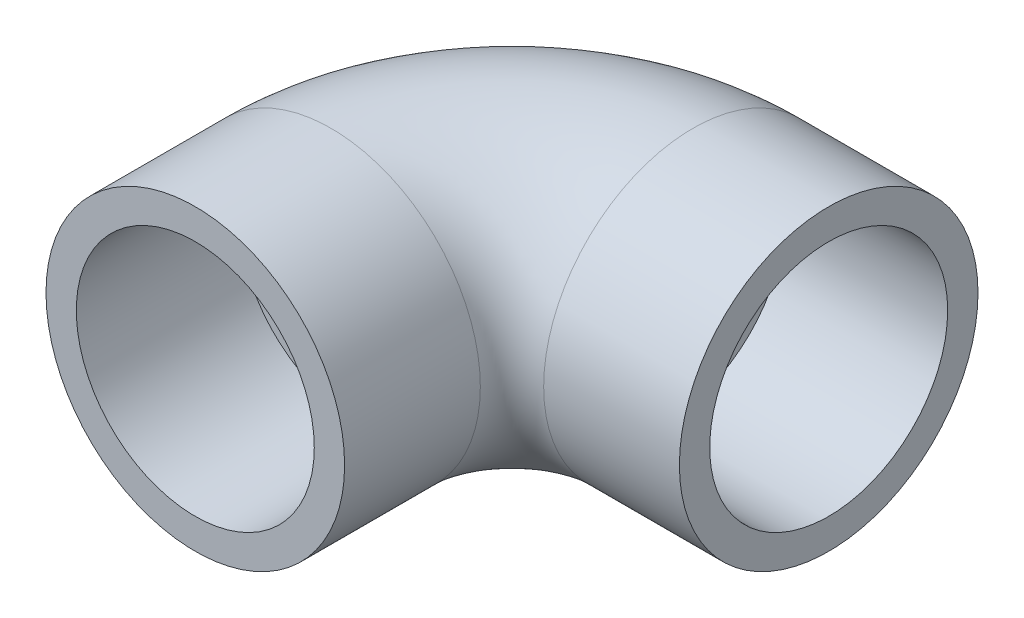
ISO-10303-21;
HEADER;
FILE_DESCRIPTION(('STEP AP214'),'2;1');
FILE_NAME('part.step','',(''),(''),'','','');
FILE_SCHEMA(('AUTOMOTIVE_DESIGN { 1 0 10303 214 1 1 1 1 }'));
ENDSEC;
DATA;
#1=APPLICATION_CONTEXT('core data for automotive mechanical design processes');
#2=APPLICATION_PROTOCOL_DEFINITION('international standard','automotive_design',2000,#1);
#3=PRODUCT_CONTEXT('',#1,'mechanical');
#4=PRODUCT('Part','Part','',(#3));
#5=PRODUCT_RELATED_PRODUCT_CATEGORY('part','',(#4));
#6=PRODUCT_DEFINITION_FORMATION('','',#4);
#7=PRODUCT_DEFINITION_CONTEXT('part definition',#1,'design');
#8=PRODUCT_DEFINITION('design','',#6,#7);
#9=PRODUCT_DEFINITION_SHAPE('','',#8);
#10=(LENGTH_UNIT() NAMED_UNIT(*) SI_UNIT(.MILLI.,.METRE.));
#11=(NAMED_UNIT(*) PLANE_ANGLE_UNIT() SI_UNIT($,.RADIAN.));
#12=(NAMED_UNIT(*) SI_UNIT($,.STERADIAN.) SOLID_ANGLE_UNIT());
#13=UNCERTAINTY_MEASURE_WITH_UNIT(LENGTH_MEASURE(1.E-05),#10,'distance_accuracy_value','');
#14=(GEOMETRIC_REPRESENTATION_CONTEXT(3) GLOBAL_UNCERTAINTY_ASSIGNED_CONTEXT((#13)) GLOBAL_UNIT_ASSIGNED_CONTEXT((#10,
#11,#12)) REPRESENTATION_CONTEXT('',''));
#15=CARTESIAN_POINT('',(0.,0.,0.));
#16=DIRECTION('',(0.,0.,1.));
#17=DIRECTION('',(1.,0.,0.));
#18=AXIS2_PLACEMENT_3D('',#15,#16,#17);
#19=CARTESIAN_POINT('',(25.4,0.,-19.05));
#20=DIRECTION('',(0.,-1.,0.));
#21=DIRECTION('',(0.,0.,-1.));
#22=AXIS2_PLACEMENT_3D('',#19,#20,#21);
#23=TOROIDAL_SURFACE('',#22,25.4,15.621);
#24=CARTESIAN_POINT('',(-10.8784735057506,-11.0133456757389,-22.86));
#25=CARTESIAN_POINT('',(-11.1881948641591,-10.7035151594159,-22.86));
#26=CARTESIAN_POINT('',(-11.4848480918916,-10.3806969330955,-22.86));
#27=CARTESIAN_POINT('',(-12.0500696928626,-9.71116570467934,-22.86));
#28=CARTESIAN_POINT('',(-12.3186308795661,-9.36444662569462,-22.86));
#29=CARTESIAN_POINT('',(-12.8258870785851,-8.64926863352895,-22.86));
#30=CARTESIAN_POINT('',(-13.0645504302218,-8.28078727225361,-22.86));
#31=CARTESIAN_POINT('',(-13.5099630096874,-7.52501595019321,-22.86));
#32=CARTESIAN_POINT('',(-13.7167124315034,-7.13772610375329,-22.86));
#33=CARTESIAN_POINT('',(-14.0967325270345,-6.34722597402654,-22.86));
#34=CARTESIAN_POINT('',(-14.2700151397829,-5.94402143024121,-22.86));
#35=CARTESIAN_POINT('',(-14.5819414962307,-5.1244211727169,-22.86));
#36=CARTESIAN_POINT('',(-14.7205846947873,-4.70802525149294,-22.86));
#37=CARTESIAN_POINT('',(-14.9621931907813,-3.8651198941996,-22.86));
#38=CARTESIAN_POINT('',(-15.0651673431114,-3.43861299632621,-22.86));
#39=CARTESIAN_POINT('',(-15.2347382457155,-2.57842978840346,-22.86));
#40=CARTESIAN_POINT('',(-15.3013351858305,-2.1447535157809,-22.86));
#41=CARTESIAN_POINT('',(-15.3975839090571,-1.27409789921084,-22.86));
#42=CARTESIAN_POINT('',(-15.4273008617413,-0.837125758424779,-22.86));
#43=CARTESIAN_POINT('',(-15.4497904321666,0.0377683239065576,-22.86));
#44=CARTESIAN_POINT('',(-15.442563060336,0.475690265183696,-22.86));
#45=CARTESIAN_POINT('',(-15.391215465377,1.34937897288,-22.86));
#46=CARTESIAN_POINT('',(-15.3470941309715,1.78514567398382,-22.86));
#47=CARTESIAN_POINT('',(-15.2222763128759,2.65140881317267,-22.86));
#48=CARTESIAN_POINT('',(-15.1415798395595,3.08190525275248,-22.86));
#49=CARTESIAN_POINT('',(-14.9442638972296,3.93426957867438,-22.86));
#50=CARTESIAN_POINT('',(-14.8276694190354,4.35614325065768,-22.86));
#51=CARTESIAN_POINT('',(-14.5593802779112,5.18857722379941,-22.86));
#52=CARTESIAN_POINT('',(-14.4076856432406,5.599137534066,-22.86));
#53=CARTESIAN_POINT('',(-14.0702901474023,6.4060369775187,-22.86));
#54=CARTESIAN_POINT('',(-13.8845893767943,6.80237614857287,-22.86));
#55=CARTESIAN_POINT('',(-13.4805183281892,7.57803528736381,-22.86));
#56=CARTESIAN_POINT('',(-13.2621480121507,7.95735523528221,-22.86));
#57=CARTESIAN_POINT('',(-12.7940302736719,8.696743032785,-22.86));
#58=CARTESIAN_POINT('',(-12.5442459588464,9.05678752477991,-22.86));
#59=CARTESIAN_POINT('',(-12.0153008453229,9.75460787070184,-22.86));
#60=CARTESIAN_POINT('',(-11.7361400408191,10.0923837202277,-22.86));
#61=CARTESIAN_POINT('',(-11.1504445952793,10.7433049971072,-22.86));
#62=CARTESIAN_POINT('',(-10.8439098702375,11.0564503488685,-22.86));
#63=CARTESIAN_POINT('',(-10.2056614336273,11.6559328466372,-22.86));
#64=CARTESIAN_POINT('',(-9.87394766073301,11.9422699273467,-22.86));
#65=CARTESIAN_POINT('',(-9.18658581738902,12.487050085864,-22.86));
#66=CARTESIAN_POINT('',(-8.83086303887741,12.7453989023338,-22.86));
#67=CARTESIAN_POINT('',(-8.09900280139839,13.2313482141238,-22.86));
#68=CARTESIAN_POINT('',(-7.72286531545211,13.4589486688075,-22.86));
#69=CARTESIAN_POINT('',(-6.95285210418346,13.8818600434066,-22.86));
#70=CARTESIAN_POINT('',(-6.55897616922635,14.0771705815892,-22.86));
#71=CARTESIAN_POINT('',(-5.75628360508556,14.4341981893787,-22.86));
#72=CARTESIAN_POINT('',(-5.34746691450834,14.5959151209269,-22.86));
#73=CARTESIAN_POINT('',(-4.5152998127864,14.8855669125549,-22.86));
#74=CARTESIAN_POINT('',(-4.09187723997879,15.0132944559067,-22.86));
#75=CARTESIAN_POINT('',(-3.23583444809936,15.2328841378699,-22.86));
#76=CARTESIAN_POINT('',(-2.80321420341991,15.3247461766129,-22.86));
#77=CARTESIAN_POINT('',(-1.93181200165477,15.4720676379061,-22.86));
#78=CARTESIAN_POINT('',(-1.49302990700106,15.5275262463978,-22.86));
#79=CARTESIAN_POINT('',(-0.612375559329773,15.6017675368956,-22.86));
#80=CARTESIAN_POINT('',(-0.170503286574758,15.6205499844304,-22.86));
#81=CARTESIAN_POINT('',(0.71754085585516,15.6214382833182,-22.86));
#82=CARTESIAN_POINT('',(1.16371308720199,15.6031886213093,-22.86));
#83=CARTESIAN_POINT('',(2.0529807811375,15.529563597046,-22.86));
#84=CARTESIAN_POINT('',(2.49607622811675,15.4741880465797,-22.86));
#85=CARTESIAN_POINT('',(3.37615530813767,15.3268382783726,-22.86));
#86=CARTESIAN_POINT('',(3.81313867960756,15.2348624992226,-22.86));
#87=CARTESIAN_POINT('',(4.67800226062167,15.0150944811188,-22.86));
#88=CARTESIAN_POINT('',(5.10588238668134,14.8873019138465,-22.86));
#89=CARTESIAN_POINT('',(5.95561235714101,14.5948709228687,-22.86));
#90=CARTESIAN_POINT('',(6.37729230968197,14.4297387501296,-22.86));
#91=CARTESIAN_POINT('',(7.20545701993348,14.0649790988155,-22.86));
#92=CARTESIAN_POINT('',(7.61194163871383,13.8653513049425,-22.86));
#93=CARTESIAN_POINT('',(8.4070023033064,13.4330829309035,-22.86));
#94=CARTESIAN_POINT('',(8.79557685115698,13.2004395959989,-22.86));
#95=CARTESIAN_POINT('',(9.55217148249618,12.7038366107659,-22.86));
#96=CARTESIAN_POINT('',(9.92019135501577,12.4398766390967,-22.86));
#97=CARTESIAN_POINT('',(10.6387764992207,11.8781172845963,-22.86));
#98=CARTESIAN_POINT('',(10.9889783556024,11.579852863688,-22.86));
#99=CARTESIAN_POINT('',(11.6631333437901,10.9549930762559,-22.86));
#100=CARTESIAN_POINT('',(11.9870860553657,10.6283972563393,-22.86));
#101=CARTESIAN_POINT('',(12.6063640651672,9.94905812636669,-22.86));
#102=CARTESIAN_POINT('',(12.9016874252038,9.59631304887105,-22.86));
#103=CARTESIAN_POINT('',(13.4614695720707,8.86684961821796,-22.86));
#104=CARTESIAN_POINT('',(13.7259137011932,8.49012001016735,-22.86));
#105=CARTESIAN_POINT('',(14.221321394835,7.71549673325917,-22.86));
#106=CARTESIAN_POINT('',(14.4523013350066,7.31761354706783,-22.86));
#107=CARTESIAN_POINT('',(14.8784883564453,6.50337197255311,-22.86));
#108=CARTESIAN_POINT('',(15.0737143579776,6.08702350143273,-22.86));
#109=CARTESIAN_POINT('',(15.4261782328064,5.23866840208691,-22.86));
#110=CARTESIAN_POINT('',(15.5834277267428,4.80666661035814,-22.86));
#111=CARTESIAN_POINT('',(15.857806597658,3.93009966842797,-22.86));
#112=CARTESIAN_POINT('',(15.97493893162,3.48553544680271,-22.86));
#113=CARTESIAN_POINT('',(16.1619401991056,2.61191682943984,-22.86));
#114=CARTESIAN_POINT('',(16.2340389436478,2.18333940086971,-22.86));
#115=CARTESIAN_POINT('',(16.3395004457698,1.32144165316175,-22.86));
#116=CARTESIAN_POINT('',(16.3728649086981,0.888121543677184,-22.86));
#117=CARTESIAN_POINT('',(16.4002673596557,0.0203924542774226,-22.86));
#118=CARTESIAN_POINT('',(16.3943191952543,-0.414016088353728,-22.86));
#119=CARTESIAN_POINT('',(16.3432346216167,-1.28051208250691,-22.86));
#120=CARTESIAN_POINT('',(16.2980992708805,-1.71259959640592,-22.86));
#121=CARTESIAN_POINT('',(16.1734862161919,-2.54394787527235,-22.86));
#122=CARTESIAN_POINT('',(16.0963498387725,-2.94356251692659,-22.86));
#123=CARTESIAN_POINT('',(15.9094529087919,-3.73505846051263,-22.86));
#124=CARTESIAN_POINT('',(15.7996938782589,-4.12694012232153,-22.86));
#125=CARTESIAN_POINT('',(15.5489031370609,-4.90060250598011,-22.86));
#126=CARTESIAN_POINT('',(15.4078672743765,-5.28238187920572,-22.86));
#127=CARTESIAN_POINT('',(15.0960090622366,-6.03371703586924,-22.86));
#128=CARTESIAN_POINT('',(14.9251757772239,-6.40326827217615,-22.86));
#129=CARTESIAN_POINT('',(14.5477409632389,-7.14291591996994,-22.86));
#130=CARTESIAN_POINT('',(14.339956671005,-7.51240875397625,-22.86));
#131=CARTESIAN_POINT('',(13.8956971444647,-8.23370828422674,-22.86));
#132=CARTESIAN_POINT('',(13.6592215574288,-8.58551476296039,-22.86));
#133=CARTESIAN_POINT('',(13.1593254485287,-9.2695874351923,-22.86));
#134=CARTESIAN_POINT('',(12.8958968534151,-9.60184772679809,-22.86));
#135=CARTESIAN_POINT('',(12.3440678236954,-10.2447617190849,-22.86));
#136=CARTESIAN_POINT('',(12.0556743729002,-10.5554214188684,-22.86));
#137=CARTESIAN_POINT('',(11.4348282030561,-11.1742835368008,-22.86));
#138=CARTESIAN_POINT('',(11.1007063019339,-11.4808137423743,-22.86));
#139=CARTESIAN_POINT('',(10.408268207627,-12.0652247314202,-22.86));
#140=CARTESIAN_POINT('',(10.0499509618618,-12.3431042671597,-22.86));
#141=CARTESIAN_POINT('',(9.31152198534265,-12.8683233041681,-22.86));
#142=CARTESIAN_POINT('',(8.93140762505816,-13.1156591093463,-22.86));
#143=CARTESIAN_POINT('',(8.15199114273321,-13.5779814825606,-22.86));
#144=CARTESIAN_POINT('',(7.75268905425995,-13.7929681071861,-22.86));
#145=CARTESIAN_POINT('',(6.9302331201118,-14.1925743310032,-22.86));
#146=CARTESIAN_POINT('',(6.50677901661631,-14.3765764596685,-22.86));
#147=CARTESIAN_POINT('',(5.64575699801038,-14.7079360099192,-22.86));
#148=CARTESIAN_POINT('',(5.20818883528971,-14.855292788221,-22.86));
#149=CARTESIAN_POINT('',(4.32209688426549,-15.1121204873287,-22.86));
#150=CARTESIAN_POINT('',(3.87357380132939,-15.2215938405311,-22.86));
#151=CARTESIAN_POINT('',(2.96879798472354,-15.4016987795302,-22.86));
#152=CARTESIAN_POINT('',(2.51254537380127,-15.4723309815424,-22.86));
#153=CARTESIAN_POINT('',(1.60128730807904,-15.573444110089,-22.86));
#154=CARTESIAN_POINT('',(1.1463354748164,-15.6044079614007,-22.86));
#155=CARTESIAN_POINT('',(0.235460163970252,-15.6274048596583,-22.86));
#156=CARTESIAN_POINT('',(-0.220463312446314,-15.6194379533332,-22.86));
#157=CARTESIAN_POINT('',(-1.13010925841306,-15.5644694882781,-22.86));
#158=CARTESIAN_POINT('',(-1.58383126522278,-15.517460052506,-22.86));
#159=CARTESIAN_POINT('',(-2.25997389193647,-15.4178646865312,-22.86));
#160=CARTESIAN_POINT('',(-2.48462286132228,-15.3798174337091,-22.86));
#161=CARTESIAN_POINT('',(-2.93213378639683,-15.2940755238027,-22.86));
#162=CARTESIAN_POINT('',(-3.15499525627017,-15.246378330607,-22.86));
#163=CARTESIAN_POINT('',(-3.81336569368636,-15.0905334864226,-22.86));
#164=CARTESIAN_POINT('',(-4.24569395234512,-14.968591922928,-22.86));
#165=CARTESIAN_POINT('',(-5.09834249546515,-14.6883694731829,-22.86));
#166=CARTESIAN_POINT('',(-5.51866290598141,-14.530088968566,-22.86));
#167=CARTESIAN_POINT('',(-6.34381360452729,-14.1784366543297,-22.86));
#168=CARTESIAN_POINT('',(-6.74866118082103,-13.9851054834934,-22.86));
#169=CARTESIAN_POINT('',(-7.54023349566654,-13.56464982393,-22.86));
#170=CARTESIAN_POINT('',(-7.92696321242016,-13.3375346904053,-22.86));
#171=CARTESIAN_POINT('',(-8.7675528971815,-12.7941728665765,-22.86));
#172=CARTESIAN_POINT('',(-9.21599720865913,-12.4694975614873,-22.86));
#173=CARTESIAN_POINT('',(-10.0760541335047,-11.774555965557,-22.86));
#174=CARTESIAN_POINT('',(-10.4876669682358,-11.4042899487551,-22.86));
#175=CARTESIAN_POINT('',(-10.8784735057506,-11.0133456757389,-22.86));
#176=B_SPLINE_CURVE_WITH_KNOTS('',3,(#24,#25,#26,#27,#28,#29,#30,#31,#32,#33,#34,#35,#36,#37,
#38,#39,#40,#41,#42,#43,#44,#45,#46,#47,#48,#49,#50,#51,#52,#53,#54,#55,#56,#57,#58,#59,#60,#61,
#62,#63,#64,#65,#66,#67,#68,#69,#70,#71,#72,#73,#74,#75,#76,#77,#78,#79,#80,#81,#82,#83,#84,#85,
#86,#87,#88,#89,#90,#91,#92,#93,#94,#95,#96,#97,#98,#99,#100,#101,#102,#103,#104,#105,#106,#107,
#108,#109,#110,#111,#112,#113,#114,#115,#116,#117,#118,#119,#120,#121,#122,#123,#124,#125,#126,
#127,#128,#129,#130,#131,#132,#133,#134,#135,#136,#137,#138,#139,#140,#141,#142,#143,#144,#145,
#146,#147,#148,#149,#150,#151,#152,#153,#154,#155,#156,#157,#158,#159,#160,#161,#162,#163,#164,
#165,#166,#167,#168,#169,#170,#171,#172,#173,#174,#175),.UNSPECIFIED.,.T.,.F.,(4,2,2,2,2,2,2,2,
2,2,2,2,2,2,2,2,2,2,2,2,2,2,2,2,2,2,2,2,2,2,2,2,2,2,2,2,2,2,2,2,2,2,2,2,2,2,2,2,2,2,2,2,2,2,2,2,
2,2,2,2,2,2,2,2,2,2,2,2,2,2,2,2,2,2,2,4),(0.,1.31378796393087,2.6279112046884,3.94341449539088,
5.25890978956467,6.57393492027791,7.88898074508285,9.20369987348638,10.5184121407306,
11.8307978942211,13.1431832772654,14.4556081918808,15.7680327342532,17.0795456748105,
18.3910575594633,19.7025659515628,21.0140758708344,22.3271406584472,23.6402057055699,
24.9532747823997,26.2663470574336,27.5837124689453,28.9010796214506,30.2184623468178,
31.535850486093,32.8610987854716,34.1863507750121,35.511632399006,36.8369224955197,
38.1749957426297,39.5130757732291,40.8512128940295,42.1893622814065,43.5463646372141,
44.9033793969957,46.26050744952,47.6176494287737,48.9960360407986,50.3744447154726,
51.752946642482,53.1321002774446,54.5105767293981,55.8883215981916,57.2656443475898,
58.6428655544747,59.9449536132391,61.2469843429946,62.548556466938,63.8500934347207,
65.0696785729989,66.2892068197774,67.5088970567243,68.7290358614804,69.9993932633659,
71.2697662845554,72.5405209414752,73.8109212520024,75.1696385282316,76.5284149514515,
77.8873556391526,79.2462939495973,80.6297362354138,82.0132028048869,83.3965805290723,
84.7799363053146,86.1462858071578,87.5126336689536,88.879257265821,89.5626191917224,
90.2461609465647,91.5919857747384,92.9377964696275,94.2820566560375,95.6259452905369,
97.2836934481536,98.94143164177),.UNSPECIFIED.);
#177=CARTESIAN_POINT('',(-10.8784735057506,-11.0133456757389,-22.86));
#178=VERTEX_POINT('',#177);
#179=EDGE_CURVE('E68',#178,#178,#176,.T.);
#180=ORIENTED_EDGE('',*,*,#179,.F.);
#181=EDGE_LOOP('',(#180));
#182=FACE_BOUND('',#181,.T.);
#183=CARTESIAN_POINT('',(21.59,-11.0133456757389,-55.3284735057506));
#184=CARTESIAN_POINT('',(21.59,-11.3256464313226,-55.0162912028326));
#185=CARTESIAN_POINT('',(21.59,-11.6246835924731,-54.6909014719289));
#186=CARTESIAN_POINT('',(21.59,-12.1942909863308,-54.0159078567745));
#187=CARTESIAN_POINT('',(21.59,-12.4648531054451,-53.6662971178658));
#188=CARTESIAN_POINT('',(21.59,-12.9757957183572,-52.9450824584802));
#189=CARTESIAN_POINT('',(21.59,-13.2161412897855,-52.5734538074884));
#190=CARTESIAN_POINT('',(21.59,-13.6646342379529,-51.8112497885135));
#191=CARTESIAN_POINT('',(21.59,-13.8727815333973,-51.4206743726965));
#192=CARTESIAN_POINT('',(21.59,-14.2553015737199,-50.6237232101941));
#193=CARTESIAN_POINT('',(21.59,-14.4297022344753,-50.2173608598377));
#194=CARTESIAN_POINT('',(21.59,-14.7437899086694,-49.3914301469097));
#195=CARTESIAN_POINT('',(21.59,-14.8834763775388,-48.9718615772856));
#196=CARTESIAN_POINT('',(21.59,-15.1272028330096,-48.1226234673896));
#197=CARTESIAN_POINT('',(21.59,-15.2312526240557,-47.6929567401657));
#198=CARTESIAN_POINT('',(21.59,-15.4031302572449,-46.8264418441532));
#199=CARTESIAN_POINT('',(21.59,-15.4709580681217,-46.3895936691659));
#200=CARTESIAN_POINT('',(21.59,-15.570344335897,-45.5089903142026));
#201=CARTESIAN_POINT('',(21.59,-15.6016704608082,-45.0652089158288));
#202=CARTESIAN_POINT('',(21.59,-15.6271797045713,-44.1765827943896));
#203=CARTESIAN_POINT('',(21.59,-15.6213626924293,-43.7317380675796));
#204=CARTESIAN_POINT('',(21.59,-15.5727586707742,-42.8440398287981));
#205=CARTESIAN_POINT('',(21.59,-15.5299686504495,-42.4011864819423));
#206=CARTESIAN_POINT('',(21.59,-15.4078527884472,-41.5205479559756));
#207=CARTESIAN_POINT('',(21.59,-15.3285266371732,-41.0827628198433));
#208=CARTESIAN_POINT('',(21.59,-15.1328006011025,-40.2097583776023));
#209=CARTESIAN_POINT('',(21.59,-15.0159458362509,-39.7746410374525));
#210=CARTESIAN_POINT('',(21.59,-14.7464456535401,-38.915638001289));
#211=CARTESIAN_POINT('',(21.59,-14.5937999702696,-38.4917523885914));
#212=CARTESIAN_POINT('',(21.59,-14.2539102504496,-37.6580703175117));
#213=CARTESIAN_POINT('',(21.59,-14.0666647912955,-37.2482744392651));
#214=CARTESIAN_POINT('',(21.59,-13.6589904305033,-36.445536047953));
#215=CARTESIAN_POINT('',(21.59,-13.4385611826874,-36.0525937107608));
#216=CARTESIAN_POINT('',(21.59,-12.9623352563095,-35.2800436510687));
#217=CARTESIAN_POINT('',(21.59,-12.706029092737,-34.9007499085908));
#218=CARTESIAN_POINT('',(21.59,-12.1626619870653,-34.1648676934632));
#219=CARTESIAN_POINT('',(21.59,-11.875600629145,-33.8082795279048));
#220=CARTESIAN_POINT('',(21.59,-11.2726941628112,-33.1202600819516));
#221=CARTESIAN_POINT('',(21.59,-10.9568460589993,-32.7888314261156));
#222=CARTESIAN_POINT('',(21.59,-10.2984098225488,-32.1534499707799));
#223=CARTESIAN_POINT('',(21.59,-9.95581242477446,-31.8495067707759));
#224=CARTESIAN_POINT('',(21.59,-9.24324105915406,-31.2691193603594));
#225=CARTESIAN_POINT('',(21.59,-8.87306113987936,-30.9929278319082));
#226=CARTESIAN_POINT('',(21.59,-8.11032976640878,-30.4733317136157));
#227=CARTESIAN_POINT('',(21.59,-7.71777756733583,-30.2299282163488));
#228=CARTESIAN_POINT('',(21.59,-6.91291432892189,-29.7782744130351));
#229=CARTESIAN_POINT('',(21.59,-6.50060294936331,-29.5700247125529));
#230=CARTESIAN_POINT('',(21.59,-5.65924484628017,-29.1911255685007));
#231=CARTESIAN_POINT('',(21.59,-5.23020590523688,-29.0204588794837));
#232=CARTESIAN_POINT('',(21.59,-4.37299250896819,-28.7239510464291));
#233=CARTESIAN_POINT('',(21.59,-3.94527230631764,-28.5967977153704));
#234=CARTESIAN_POINT('',(21.59,-3.08010910188294,-28.3814871183312));
#235=CARTESIAN_POINT('',(21.59,-2.64266638902519,-28.2933286951516));
#236=CARTESIAN_POINT('',(21.59,-1.76183606036327,-28.1575233426917));
#237=CARTESIAN_POINT('',(21.59,-1.31845283014015,-28.1098480381963));
#238=CARTESIAN_POINT('',(21.59,-0.429185448045911,-28.0557784037691));
#239=CARTESIAN_POINT('',(21.59,0.0166985401389792,-28.0493814028265));
#240=CARTESIAN_POINT('',(21.59,0.873540986700462,-28.0768955312121));
#241=CARTESIAN_POINT('',(21.59,1.28459914499073,-28.1078053021326));
#242=CARTESIAN_POINT('',(21.59,2.10256855208606,-28.204507374297));
#243=CARTESIAN_POINT('',(21.59,2.50948000893747,-28.2702979166498));
#244=CARTESIAN_POINT('',(21.59,3.3164349682014,-28.4358051155349));
#245=CARTESIAN_POINT('',(21.59,3.71647664632825,-28.5355306415929));
#246=CARTESIAN_POINT('',(21.59,4.50698742423063,-28.7675715575991));
#247=CARTESIAN_POINT('',(21.59,4.89745622227916,-28.8998879733293));
#248=CARTESIAN_POINT('',(21.59,5.66799116663128,-29.1961571386719));
#249=CARTESIAN_POINT('',(21.59,6.04800900474989,-29.3602353328808));
#250=CARTESIAN_POINT('',(21.59,6.79397427227493,-29.7180886597112));
#251=CARTESIAN_POINT('',(21.59,7.15991565546204,-29.9118763790792));
#252=CARTESIAN_POINT('',(21.59,7.87553574850032,-30.3273855476251));
#253=CARTESIAN_POINT('',(21.59,8.22521549524402,-30.5491052124223));
#254=CARTESIAN_POINT('',(21.59,8.90648435148512,-31.0187941937307));
#255=CARTESIAN_POINT('',(21.59,9.2380725004676,-31.2667649019051));
#256=CARTESIAN_POINT('',(21.59,9.90564107899313,-31.8068797700439));
#257=CARTESIAN_POINT('',(21.59,10.2400695448657,-32.1009445587617));
#258=CARTESIAN_POINT('',(21.59,10.8838784291824,-32.7153306076428));
#259=CARTESIAN_POINT('',(21.59,11.1932577725477,-33.035652993565));
#260=CARTESIAN_POINT('',(21.59,11.7850367142642,-33.7004111513871));
#261=CARTESIAN_POINT('',(21.59,12.0674320937774,-34.044850679369));
#262=CARTESIAN_POINT('',(21.59,12.603326391626,-34.7555140909152));
#263=CARTESIAN_POINT('',(21.59,12.8568253613865,-35.1217379357095));
#264=CARTESIAN_POINT('',(21.59,13.3416902512196,-35.8869835507932));
#265=CARTESIAN_POINT('',(21.59,13.5719471682532,-36.28670875497));
#266=CARTESIAN_POINT('',(21.59,13.9978821454905,-37.1041900146761));
#267=CARTESIAN_POINT('',(21.59,14.1935592355972,-37.5219465756453));
#268=CARTESIAN_POINT('',(21.59,14.5487931793742,-38.3725572200395));
#269=CARTESIAN_POINT('',(21.59,14.7083495275052,-38.8054115146718));
#270=CARTESIAN_POINT('',(21.59,14.9900266743346,-39.6831329263319));
#271=CARTESIAN_POINT('',(21.59,15.1121479769157,-40.1279998815794));
#272=CARTESIAN_POINT('',(21.59,15.3172781455055,-41.0238205171403));
#273=CARTESIAN_POINT('',(21.59,15.4005200290248,-41.4747208280285));
#274=CARTESIAN_POINT('',(21.59,15.5282165495168,-42.3819862657084));
#275=CARTESIAN_POINT('',(21.59,15.5726711861711,-42.8383513925449));
#276=CARTESIAN_POINT('',(21.59,15.6223093874383,-43.7531898435749));
#277=CARTESIAN_POINT('',(21.59,15.6274951941867,-44.2116630459078));
#278=CARTESIAN_POINT('',(21.59,15.5984156487853,-45.1273570301793));
#279=CARTESIAN_POINT('',(21.59,15.5641507993284,-45.584577828002));
#280=CARTESIAN_POINT('',(21.59,15.457161158064,-46.4870215953863));
#281=CARTESIAN_POINT('',(21.59,15.3850650725423,-46.9323191710095));
#282=CARTESIAN_POINT('',(21.59,15.2032073742665,-47.8151565191023));
#283=CARTESIAN_POINT('',(21.59,15.0934461270343,-48.2526963668135));
#284=CARTESIAN_POINT('',(21.59,14.8369612158865,-49.1167804618274));
#285=CARTESIAN_POINT('',(21.59,14.690239603191,-49.5433253178806));
#286=CARTESIAN_POINT('',(21.59,14.3608144756914,-50.3822876004764));
#287=CARTESIAN_POINT('',(21.59,14.1781112296733,-50.7947051325242));
#288=CARTESIAN_POINT('',(21.59,13.7806020514889,-51.5970702227326));
#289=CARTESIAN_POINT('',(21.59,13.5662460184779,-51.9872407288698));
#290=CARTESIAN_POINT('',(21.59,13.1051988059023,-52.7479848267865));
#291=CARTESIAN_POINT('',(21.59,12.858507910156,-53.1185585905357));
#292=CARTESIAN_POINT('',(21.59,12.3345278250618,-53.8373837064257));
#293=CARTESIAN_POINT('',(21.59,12.0572397130479,-54.1856358438332));
#294=CARTESIAN_POINT('',(21.59,11.4740230323797,-54.8572712535622));
#295=CARTESIAN_POINT('',(21.59,11.168094582073,-55.1806546286363));
#296=CARTESIAN_POINT('',(21.59,10.5325135851935,-55.7975194095906));
#297=CARTESIAN_POINT('',(21.59,10.2030859812935,-56.0912326161903));
#298=CARTESIAN_POINT('',(21.59,9.52056106518147,-56.6497323584876));
#299=CARTESIAN_POINT('',(21.59,9.16746389420569,-56.9145190667648));
#300=CARTESIAN_POINT('',(21.59,8.44011965481614,-57.4132312307683));
#301=CARTESIAN_POINT('',(21.59,8.06587302567683,-57.6471573271337));
#302=CARTESIAN_POINT('',(21.59,7.29889813531365,-58.0824460940915));
#303=CARTESIAN_POINT('',(21.59,6.90616991513471,-58.2838088369981));
#304=CARTESIAN_POINT('',(21.59,6.10707789392463,-58.6515643631274));
#305=CARTESIAN_POINT('',(21.59,5.70079315136626,-58.8181289521573));
#306=CARTESIAN_POINT('',(21.59,4.87561070075285,-59.116357647378));
#307=CARTESIAN_POINT('',(21.59,4.45671303650514,-59.2480218747697));
#308=CARTESIAN_POINT('',(21.59,3.60931555612794,-59.4754882429032));
#309=CARTESIAN_POINT('',(21.59,3.18081625697005,-59.5712923095354));
#310=CARTESIAN_POINT('',(21.59,2.31725535804009,-59.7263523077626));
#311=CARTESIAN_POINT('',(21.59,1.8821937711268,-59.785608310964));
#312=CARTESIAN_POINT('',(21.59,1.00979187926333,-59.867032420911));
#313=CARTESIAN_POINT('',(21.59,0.572460815883041,-59.8892995759117));
#314=CARTESIAN_POINT('',(21.59,-0.302523082519428,-59.8968927303175));
#315=CARTESIAN_POINT('',(21.59,-0.74017591819728,-59.8822186542378));
#316=CARTESIAN_POINT('',(21.59,-1.61280012908849,-59.816026623312));
#317=CARTESIAN_POINT('',(21.59,-2.04777078239289,-59.7644991515561));
#318=CARTESIAN_POINT('',(21.59,-2.9118132541986,-59.6249638222786));
#319=CARTESIAN_POINT('',(21.59,-3.34088516884977,-59.5369565601105));
#320=CARTESIAN_POINT('',(21.59,-4.1900512418954,-59.3251064707886));
#321=CARTESIAN_POINT('',(21.59,-4.61014614370578,-59.2012666234958));
#322=CARTESIAN_POINT('',(21.59,-5.43841245188539,-58.9186437937415));
#323=CARTESIAN_POINT('',(21.59,-5.84658380807676,-58.7598606642521));
#324=CARTESIAN_POINT('',(21.59,-6.64766795426919,-58.4086883323284));
#325=CARTESIAN_POINT('',(21.59,-7.04059723452623,-58.2163367611556));
#326=CARTESIAN_POINT('',(21.59,-7.80877775211949,-57.7993662713719));
#327=CARTESIAN_POINT('',(21.59,-8.18403378438122,-57.5747561725686));
#328=CARTESIAN_POINT('',(21.59,-8.9925497212568,-57.0434350243717));
#329=CARTESIAN_POINT('',(21.59,-9.42104722584987,-56.7294392501726));
#330=CARTESIAN_POINT('',(21.59,-10.2438588808406,-56.0594736309352));
#331=CARTESIAN_POINT('',(21.59,-10.6381730604126,-55.703503821721));
#332=CARTESIAN_POINT('',(21.59,-11.0133456757389,-55.3284735057506));
#333=B_SPLINE_CURVE_WITH_KNOTS('',3,(#183,#184,#185,#186,#187,#188,#189,#190,#191,#192,#193,
#194,#195,#196,#197,#198,#199,#200,#201,#202,#203,#204,#205,#206,#207,#208,#209,#210,#211,#212,
#213,#214,#215,#216,#217,#218,#219,#220,#221,#222,#223,#224,#225,#226,#227,#228,#229,#230,#231,
#232,#233,#234,#235,#236,#237,#238,#239,#240,#241,#242,#243,#244,#245,#246,#247,#248,#249,#250,
#251,#252,#253,#254,#255,#256,#257,#258,#259,#260,#261,#262,#263,#264,#265,#266,#267,#268,#269,
#270,#271,#272,#273,#274,#275,#276,#277,#278,#279,#280,#281,#282,#283,#284,#285,#286,#287,#288,
#289,#290,#291,#292,#293,#294,#295,#296,#297,#298,#299,#300,#301,#302,#303,#304,#305,#306,#307,
#308,#309,#310,#311,#312,#313,#314,#315,#316,#317,#318,#319,#320,#321,#322,#323,#324,#325,#326,
#327,#328,#329,#330,#331,#332),.UNSPECIFIED.,.T.,.F.,(4,2,2,2,2,2,2,2,2,2,2,2,2,2,2,2,2,2,2,2,2,
2,2,2,2,2,2,2,2,2,2,2,2,2,2,2,2,2,2,2,2,2,2,2,2,2,2,2,2,2,2,2,2,2,2,2,2,2,2,2,2,2,2,2,2,2,2,2,2,
2,2,2,2,2,4),(0.,1.3242594240696,2.64889516283638,3.97504802645887,5.30120423831577,
6.62625869347942,7.9513339337594,9.27604432290142,10.600755855516,11.9338538536451,
13.2669565532549,14.6001678212368,15.9333903866609,17.2834246640962,18.6334689531688,
19.9835687630295,21.3336826582914,22.7054000928006,24.0771360757528,25.4490149576941,
26.821371142587,28.2052653977997,29.5892057562252,30.973169952184,32.3564977689891,
33.6933986535842,35.0302598621223,36.3661832696425,37.7020202321907,38.9371862427395,
40.172289974969,41.4077167723108,42.643182459062,43.8836310780097,45.1246066855148,
46.3655030557537,47.6064652433947,48.9409418185532,50.2754756375466,51.6102177654862,
52.9449575180338,54.3272070968949,55.709495447019,57.0918031422079,58.4740922304588,
59.8479869827342,61.2218817462936,62.5956980638828,63.9694968760511,65.3211560187476,
66.6728020446277,68.024373073609,69.3759340066253,70.7098627776452,72.0437798409329,
73.377649951721,74.7115145509357,76.033986700635,77.3564509598539,78.6788877615645,
80.0013216264732,81.3170634370389,82.6328006782828,83.9484672469688,85.2641312379455,
86.5762664480486,87.8884043393425,89.2008811955707,90.5133366329029,91.8256829569437,
93.1380348029366,94.4489248030889,95.759457072563,97.3503155211691,98.9411726120206),.UNSPECIFIED.);
#334=CARTESIAN_POINT('',(21.59,-11.0133456757389,-55.3284735057506));
#335=VERTEX_POINT('',#334);
#336=EDGE_CURVE('E36',#335,#335,#333,.T.);
#337=ORIENTED_EDGE('',*,*,#336,.F.);
#338=EDGE_LOOP('',(#337));
#339=FACE_BOUND('',#338,.T.);
#340=ADVANCED_FACE('F32',(#182,#339),#23,.F.);
#341=CARTESIAN_POINT('',(0.,0.,0.));
#342=DIRECTION('',(0.,0.,-1.));
#343=DIRECTION('',(-1.,0.,0.));
#344=AXIS2_PLACEMENT_3D('',#341,#342,#343);
#345=CYLINDRICAL_SURFACE('',#344,20.955);
#346=CARTESIAN_POINT('',(0.,0.,-19.05));
#347=DIRECTION('',(0.,0.,1.));
#348=DIRECTION('',(1.,0.,0.));
#349=AXIS2_PLACEMENT_3D('',#346,#347,#348);
#350=CIRCLE('',#349,20.955);
#351=CARTESIAN_POINT('',(-20.955,0.,-19.05));
#352=VERTEX_POINT('',#351);
#353=EDGE_CURVE('E64',#352,#352,#350,.T.);
#354=ORIENTED_EDGE('',*,*,#353,.T.);
#355=EDGE_LOOP('',(#354));
#356=FACE_BOUND('',#355,.T.);
#357=CARTESIAN_POINT('',(0.,0.,0.));
#358=DIRECTION('',(0.,0.,1.));
#359=DIRECTION('',(1.,0.,0.));
#360=AXIS2_PLACEMENT_3D('',#357,#358,#359);
#361=CIRCLE('',#360,20.955);
#362=CARTESIAN_POINT('',(20.955,0.,0.));
#363=VERTEX_POINT('',#362);
#364=EDGE_CURVE('E46',#363,#363,#361,.T.);
#365=ORIENTED_EDGE('',*,*,#364,.F.);
#366=EDGE_LOOP('',(#365));
#367=FACE_BOUND('',#366,.T.);
#368=ADVANCED_FACE('F85',(#356,#367),#345,.T.);
#369=CARTESIAN_POINT('',(25.4,0.,-19.05));
#370=DIRECTION('',(0.,-1.,0.));
#371=DIRECTION('',(0.,0.,-1.));
#372=AXIS2_PLACEMENT_3D('',#369,#370,#371);
#373=TOROIDAL_SURFACE('',#372,25.4,20.955);
#374=CARTESIAN_POINT('',(25.4,0.,-44.45));
#375=DIRECTION('',(-1.,0.,0.));
#376=DIRECTION('',(0.,0.,1.));
#377=AXIS2_PLACEMENT_3D('',#374,#375,#376);
#378=CIRCLE('',#377,20.955);
#379=CARTESIAN_POINT('',(25.4,0.,-65.405));
#380=VERTEX_POINT('',#379);
#381=EDGE_CURVE('E62',#380,#380,#378,.T.);
#382=CARTESIAN_POINT('',(25.4,0.,-19.05));
#383=DIRECTION('',(0.,-1.,0.));
#384=DIRECTION('',(0.,0.,-1.));
#385=AXIS2_PLACEMENT_3D('',#382,#383,#384);
#386=CIRCLE('',#385,46.355);
#387=EDGE_CURVE('',#352,#380,#386,.T.);
#388=ORIENTED_EDGE('',*,*,#353,.F.);
#389=ORIENTED_EDGE('',*,*,#381,.T.);
#390=ORIENTED_EDGE('',*,*,#387,.T.);
#391=ORIENTED_EDGE('',*,*,#387,.F.);
#392=EDGE_LOOP('',(#388,#390,#389,#391));
#393=FACE_BOUND('',#392,.T.);
#394=ADVANCED_FACE('F59',(#393),#373,.T.);
#395=CARTESIAN_POINT('',(25.4,0.,-44.45));
#396=DIRECTION('',(1.,0.,0.));
#397=DIRECTION('',(0.,0.,-1.));
#398=AXIS2_PLACEMENT_3D('',#395,#396,#397);
#399=CYLINDRICAL_SURFACE('',#398,20.955);
#400=CARTESIAN_POINT('',(44.45,0.,-44.45));
#401=DIRECTION('',(-1.,0.,0.));
#402=DIRECTION('',(0.,0.,1.));
#403=AXIS2_PLACEMENT_3D('',#400,#401,#402);
#404=CIRCLE('',#403,20.955);
#405=CARTESIAN_POINT('',(44.45,0.,-23.495));
#406=VERTEX_POINT('',#405);
#407=EDGE_CURVE('E11',#406,#406,#404,.T.);
#408=ORIENTED_EDGE('',*,*,#407,.T.);
#409=EDGE_LOOP('',(#408));
#410=FACE_BOUND('',#409,.T.);
#411=ORIENTED_EDGE('',*,*,#381,.F.);
#412=EDGE_LOOP('',(#411));
#413=FACE_BOUND('',#412,.T.);
#414=ADVANCED_FACE('F34',(#410,#413),#399,.T.);
#415=CARTESIAN_POINT('',(0.,0.,0.));
#416=DIRECTION('',(0.,0.,1.));
#417=DIRECTION('',(1.,0.,0.));
#418=AXIS2_PLACEMENT_3D('',#415,#416,#417);
#419=PLANE('',#418);
#420=CARTESIAN_POINT('',(0.,0.,0.));
#421=DIRECTION('',(0.,0.,1.));
#422=DIRECTION('',(1.,0.,0.));
#423=AXIS2_PLACEMENT_3D('',#420,#421,#422);
#424=CIRCLE('',#423,16.7005);
#425=CARTESIAN_POINT('',(16.7005,0.,0.));
#426=VERTEX_POINT('',#425);
#427=EDGE_CURVE('E176',#426,#426,#424,.T.);
#428=ORIENTED_EDGE('',*,*,#427,.F.);
#429=EDGE_LOOP('',(#428));
#430=FACE_BOUND('',#429,.T.);
#431=ORIENTED_EDGE('',*,*,#364,.T.);
#432=EDGE_LOOP('',(#431));
#433=FACE_BOUND('',#432,.T.);
#434=ADVANCED_FACE('F58',(#430,#433),#419,.T.);
#435=CARTESIAN_POINT('',(44.45,0.,-44.45));
#436=DIRECTION('',(-1.,0.,0.));
#437=DIRECTION('',(0.,0.,1.));
#438=AXIS2_PLACEMENT_3D('',#435,#436,#437);
#439=PLANE('',#438);
#440=CARTESIAN_POINT('',(44.45,0.,-44.45));
#441=DIRECTION('',(1.,0.,0.));
#442=DIRECTION('',(0.,0.,-1.));
#443=AXIS2_PLACEMENT_3D('',#440,#441,#442);
#444=CIRCLE('',#443,16.7005);
#445=CARTESIAN_POINT('',(44.45,0.,-61.1505));
#446=VERTEX_POINT('',#445);
#447=EDGE_CURVE('E170',#446,#446,#444,.T.);
#448=ORIENTED_EDGE('',*,*,#447,.F.);
#449=EDGE_LOOP('',(#448));
#450=FACE_BOUND('',#449,.T.);
#451=ORIENTED_EDGE('',*,*,#407,.F.);
#452=EDGE_LOOP('',(#451));
#453=FACE_BOUND('',#452,.T.);
#454=ADVANCED_FACE('F54',(#450,#453),#439,.F.);
#455=CARTESIAN_POINT('',(0.,0.,-22.86));
#456=DIRECTION('',(0.,0.,1.));
#457=DIRECTION('',(1.,0.,0.));
#458=AXIS2_PLACEMENT_3D('',#455,#456,#457);
#459=PLANE('',#458);
#460=CARTESIAN_POINT('',(0.,0.,-22.86));
#461=DIRECTION('',(0.,0.,1.));
#462=DIRECTION('',(1.,0.,0.));
#463=AXIS2_PLACEMENT_3D('',#460,#461,#462);
#464=CIRCLE('',#463,16.7005);
#465=CARTESIAN_POINT('',(16.7005,0.,-22.86));
#466=VERTEX_POINT('',#465);
#467=EDGE_CURVE('E75',#466,#466,#464,.T.);
#468=ORIENTED_EDGE('',*,*,#467,.T.);
#469=EDGE_LOOP('',(#468));
#470=FACE_BOUND('',#469,.T.);
#471=ORIENTED_EDGE('',*,*,#179,.T.);
#472=EDGE_LOOP('',(#471));
#473=FACE_BOUND('',#472,.T.);
#474=ADVANCED_FACE('F79',(#470,#473),#459,.T.);
#475=CARTESIAN_POINT('',(0.,0.,-22.86));
#476=DIRECTION('',(0.,0.,1.));
#477=DIRECTION('',(1.,0.,0.));
#478=AXIS2_PLACEMENT_3D('',#475,#476,#477);
#479=CYLINDRICAL_SURFACE('',#478,16.7005);
#480=ORIENTED_EDGE('',*,*,#467,.F.);
#481=EDGE_LOOP('',(#480));
#482=FACE_BOUND('',#481,.T.);
#483=ORIENTED_EDGE('',*,*,#427,.T.);
#484=EDGE_LOOP('',(#483));
#485=FACE_BOUND('',#484,.T.);
#486=ADVANCED_FACE('F83',(#482,#485),#479,.F.);
#487=CARTESIAN_POINT('',(21.59,0.,-44.45));
#488=DIRECTION('',(1.,0.,0.));
#489=DIRECTION('',(0.,0.,-1.));
#490=AXIS2_PLACEMENT_3D('',#487,#488,#489);
#491=PLANE('',#490);
#492=CARTESIAN_POINT('',(21.59,0.,-44.45));
#493=DIRECTION('',(1.,0.,0.));
#494=DIRECTION('',(0.,0.,-1.));
#495=AXIS2_PLACEMENT_3D('',#492,#493,#494);
#496=CIRCLE('',#495,16.7005);
#497=CARTESIAN_POINT('',(21.59,0.,-61.1505));
#498=VERTEX_POINT('',#497);
#499=EDGE_CURVE('E168',#498,#498,#496,.T.);
#500=ORIENTED_EDGE('',*,*,#499,.T.);
#501=EDGE_LOOP('',(#500));
#502=FACE_BOUND('',#501,.T.);
#503=ORIENTED_EDGE('',*,*,#336,.T.);
#504=EDGE_LOOP('',(#503));
#505=FACE_BOUND('',#504,.T.);
#506=ADVANCED_FACE('F88',(#502,#505),#491,.T.);
#507=CARTESIAN_POINT('',(21.59,0.,-44.45));
#508=DIRECTION('',(1.,0.,0.));
#509=DIRECTION('',(0.,0.,-1.));
#510=AXIS2_PLACEMENT_3D('',#507,#508,#509);
#511=CYLINDRICAL_SURFACE('',#510,16.7005);
#512=ORIENTED_EDGE('',*,*,#499,.F.);
#513=EDGE_LOOP('',(#512));
#514=FACE_BOUND('',#513,.T.);
#515=ORIENTED_EDGE('',*,*,#447,.T.);
#516=EDGE_LOOP('',(#515));
#517=FACE_BOUND('',#516,.T.);
#518=ADVANCED_FACE('F86',(#514,#517),#511,.F.);
#519=CLOSED_SHELL('',(#340,#368,#394,#414,#434,#454,#474,#486,#506,#518));
#520=MANIFOLD_SOLID_BREP('B2',#519);
#521=ADVANCED_BREP_SHAPE_REPRESENTATION('',(#18,#520),#14);
#522=SHAPE_DEFINITION_REPRESENTATION(#9,#521);
ENDSEC;
END-ISO-10303-21;
